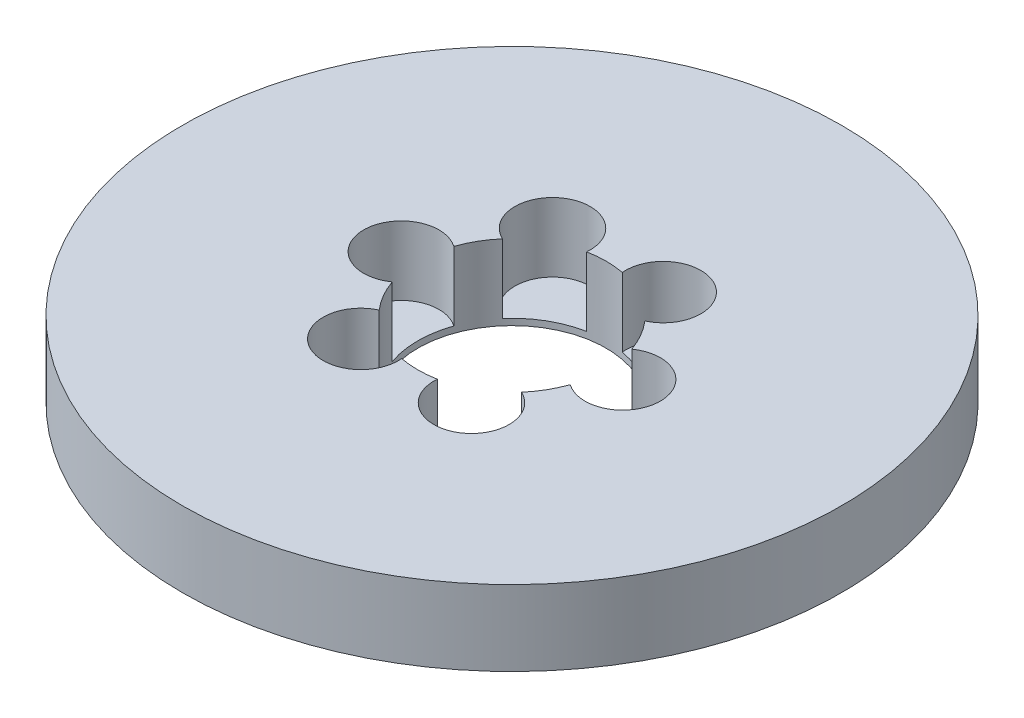
ISO-10303-21;
HEADER;
FILE_DESCRIPTION(('STEP AP214'),'2;1');
FILE_NAME('part.step','',(''),(''),'','','');
FILE_SCHEMA(('AUTOMOTIVE_DESIGN { 1 0 10303 214 1 1 1 1 }'));
ENDSEC;
DATA;
#1=APPLICATION_CONTEXT('core data for automotive mechanical design processes');
#2=APPLICATION_PROTOCOL_DEFINITION('international standard','automotive_design',2000,#1);
#3=PRODUCT_CONTEXT('',#1,'mechanical');
#4=PRODUCT('Part','Part','',(#3));
#5=PRODUCT_RELATED_PRODUCT_CATEGORY('part','',(#4));
#6=PRODUCT_DEFINITION_FORMATION('','',#4);
#7=PRODUCT_DEFINITION_CONTEXT('part definition',#1,'design');
#8=PRODUCT_DEFINITION('design','',#6,#7);
#9=PRODUCT_DEFINITION_SHAPE('','',#8);
#10=(LENGTH_UNIT() NAMED_UNIT(*) SI_UNIT(.MILLI.,.METRE.));
#11=(NAMED_UNIT(*) PLANE_ANGLE_UNIT() SI_UNIT($,.RADIAN.));
#12=(NAMED_UNIT(*) SI_UNIT($,.STERADIAN.) SOLID_ANGLE_UNIT());
#13=UNCERTAINTY_MEASURE_WITH_UNIT(LENGTH_MEASURE(1.E-05),#10,'distance_accuracy_value','');
#14=(GEOMETRIC_REPRESENTATION_CONTEXT(3) GLOBAL_UNCERTAINTY_ASSIGNED_CONTEXT((#13)) GLOBAL_UNIT_ASSIGNED_CONTEXT((#10,
#11,#12)) REPRESENTATION_CONTEXT('',''));
#15=CARTESIAN_POINT('',(0.,0.,0.));
#16=DIRECTION('',(0.,0.,1.));
#17=DIRECTION('',(1.,0.,0.));
#18=AXIS2_PLACEMENT_3D('',#15,#16,#17);
#19=CARTESIAN_POINT('',(0.,20.,0.));
#20=DIRECTION('',(0.,-1.,0.));
#21=DIRECTION('',(0.,0.,-1.));
#22=AXIS2_PLACEMENT_3D('',#19,#20,#21);
#23=CYLINDRICAL_SURFACE('',#22,87.5);
#24=CARTESIAN_POINT('',(0.,20.,0.));
#25=DIRECTION('',(0.,1.,0.));
#26=DIRECTION('',(0.,0.,1.));
#27=AXIS2_PLACEMENT_3D('',#24,#25,#26);
#28=CIRCLE('',#27,87.5);
#29=CARTESIAN_POINT('',(0.,20.,87.5));
#30=VERTEX_POINT('',#29);
#31=EDGE_CURVE('E171',#30,#30,#28,.T.);
#32=ORIENTED_EDGE('',*,*,#31,.F.);
#33=EDGE_LOOP('',(#32));
#34=FACE_BOUND('',#33,.T.);
#35=CARTESIAN_POINT('',(0.,0.,0.));
#36=DIRECTION('',(0.,1.,0.));
#37=DIRECTION('',(0.,0.,1.));
#38=AXIS2_PLACEMENT_3D('',#35,#36,#37);
#39=CIRCLE('',#38,87.5);
#40=CARTESIAN_POINT('',(0.,0.,87.5));
#41=VERTEX_POINT('',#40);
#42=EDGE_CURVE('E157',#41,#41,#39,.T.);
#43=ORIENTED_EDGE('',*,*,#42,.T.);
#44=EDGE_LOOP('',(#43));
#45=FACE_BOUND('',#44,.T.);
#46=ADVANCED_FACE('F39',(#34,#45),#23,.T.);
#47=CARTESIAN_POINT('',(0.,20.,0.));
#48=DIRECTION('',(0.,1.,0.));
#49=DIRECTION('',(0.,0.,1.));
#50=AXIS2_PLACEMENT_3D('',#47,#48,#49);
#51=PLANE('',#50);
#52=CARTESIAN_POINT('',(-14.6925083448356,20.,-25.4481709438842));
#53=DIRECTION('',(0.,1.,0.));
#54=DIRECTION('',(-0.866025403784433,0.,0.50000000000001));
#55=AXIS2_PLACEMENT_3D('',#52,#53,#54);
#56=CIRCLE('',#55,10.);
#57=CARTESIAN_POINT('',(-4.73311850292256,20.,-24.547863231599));
#58=VERTEX_POINT('',#57);
#59=CARTESIAN_POINT('',(-18.8925139157298,20.,-16.3729324784522));
#60=VERTEX_POINT('',#59);
#61=EDGE_CURVE('E214',#58,#60,#56,.T.);
#62=ORIENTED_EDGE('',*,*,#61,.F.);
#63=CARTESIAN_POINT('',(0.,20.,0.));
#64=DIRECTION('',(0.,1.,0.));
#65=DIRECTION('',(0.,0.,1.));
#66=AXIS2_PLACEMENT_3D('',#63,#64,#65);
#67=CIRCLE('',#66,25.);
#68=CARTESIAN_POINT('',(4.73311850292204,20.,-24.5478632315991));
#69=VERTEX_POINT('',#68);
#70=EDGE_CURVE('E272',#69,#58,#67,.T.);
#71=ORIENTED_EDGE('',*,*,#70,.F.);
#72=CARTESIAN_POINT('',(14.692508344835,20.,-25.4481709438845));
#73=DIRECTION('',(0.,1.,0.));
#74=DIRECTION('',(-0.866025403784443,0.,-0.499999999999992));
#75=AXIS2_PLACEMENT_3D('',#72,#73,#74);
#76=CIRCLE('',#75,10.);
#77=CARTESIAN_POINT('',(18.8925139157295,20.,-16.3729324784526));
#78=VERTEX_POINT('',#77);
#79=EDGE_CURVE('E285',#78,#69,#76,.T.);
#80=ORIENTED_EDGE('',*,*,#79,.F.);
#81=CARTESIAN_POINT('',(23.6256324186519,20.,-8.17493075314669));
#82=VERTEX_POINT('',#81);
#83=EDGE_CURVE('E165',#82,#78,#67,.T.);
#84=ORIENTED_EDGE('',*,*,#83,.F.);
#85=CARTESIAN_POINT('',(29.3850166896705,20.,0.));
#86=DIRECTION('',(0.,1.,0.));
#87=DIRECTION('',(0.,0.,-1.));
#88=AXIS2_PLACEMENT_3D('',#85,#86,#87);
#89=CIRCLE('',#88,10.);
#90=CARTESIAN_POINT('',(23.6256324186519,20.,8.17493075314669));
#91=VERTEX_POINT('',#90);
#92=EDGE_CURVE('E281',#91,#82,#89,.T.);
#93=ORIENTED_EDGE('',*,*,#92,.F.);
#94=CARTESIAN_POINT('',(18.8925139157297,20.,16.3729324784523));
#95=VERTEX_POINT('',#94);
#96=EDGE_CURVE('E160',#95,#91,#67,.T.);
#97=ORIENTED_EDGE('',*,*,#96,.F.);
#98=CARTESIAN_POINT('',(14.6925083448354,20.,25.4481709438843));
#99=DIRECTION('',(0.,1.,0.));
#100=DIRECTION('',(0.866025403784436,0.,-0.500000000000004));
#101=AXIS2_PLACEMENT_3D('',#98,#99,#100);
#102=CIRCLE('',#101,10.);
#103=CARTESIAN_POINT('',(4.73311850292239,20.,24.5478632315991));
#104=VERTEX_POINT('',#103);
#105=EDGE_CURVE('E154',#104,#95,#102,.T.);
#106=ORIENTED_EDGE('',*,*,#105,.F.);
#107=CARTESIAN_POINT('',(-4.73311850292221,20.,24.5478632315991));
#108=VERTEX_POINT('',#107);
#109=EDGE_CURVE('E150',#108,#104,#67,.T.);
#110=ORIENTED_EDGE('',*,*,#109,.F.);
#111=CARTESIAN_POINT('',(-14.6925083448352,20.,25.4481709438844));
#112=DIRECTION('',(0.,1.,0.));
#113=DIRECTION('',(0.86602540378444,0.,0.499999999999998));
#114=AXIS2_PLACEMENT_3D('',#111,#112,#113);
#115=CIRCLE('',#114,10.);
#116=CARTESIAN_POINT('',(-18.8925139157296,20.,16.3729324784525));
#117=VERTEX_POINT('',#116);
#118=EDGE_CURVE('E127',#117,#108,#115,.T.);
#119=ORIENTED_EDGE('',*,*,#118,.F.);
#120=CARTESIAN_POINT('',(-23.6256324186519,20.,8.17493075314669));
#121=VERTEX_POINT('',#120);
#122=EDGE_CURVE('E156',#121,#117,#67,.T.);
#123=ORIENTED_EDGE('',*,*,#122,.F.);
#124=CARTESIAN_POINT('',(-29.3850166896705,20.,0.));
#125=DIRECTION('',(0.,1.,0.));
#126=DIRECTION('',(0.,0.,1.));
#127=AXIS2_PLACEMENT_3D('',#124,#125,#126);
#128=CIRCLE('',#127,10.);
#129=CARTESIAN_POINT('',(-23.6256324186519,20.,-8.17493075314669));
#130=VERTEX_POINT('',#129);
#131=EDGE_CURVE('E164',#130,#121,#128,.T.);
#132=ORIENTED_EDGE('',*,*,#131,.F.);
#133=EDGE_CURVE('E159',#60,#130,#67,.T.);
#134=ORIENTED_EDGE('',*,*,#133,.F.);
#135=EDGE_LOOP('',(#62,#71,#80,#84,#93,#97,#106,#110,#119,#123,#132,#134));
#136=FACE_BOUND('',#135,.T.);
#137=ORIENTED_EDGE('',*,*,#31,.T.);
#138=EDGE_LOOP('',(#137));
#139=FACE_BOUND('',#138,.T.);
#140=ADVANCED_FACE('F155',(#136,#139),#51,.T.);
#141=CARTESIAN_POINT('',(0.,0.,0.));
#142=DIRECTION('',(0.,1.,0.));
#143=DIRECTION('',(0.,0.,1.));
#144=AXIS2_PLACEMENT_3D('',#141,#142,#143);
#145=PLANE('',#144);
#146=CARTESIAN_POINT('',(0.,0.,0.));
#147=DIRECTION('',(0.,1.,0.));
#148=DIRECTION('',(0.,0.,1.));
#149=AXIS2_PLACEMENT_3D('',#146,#147,#148);
#150=CIRCLE('',#149,25.);
#151=CARTESIAN_POINT('',(0.,0.,25.));
#152=VERTEX_POINT('',#151);
#153=EDGE_CURVE('E170',#152,#152,#150,.T.);
#154=ORIENTED_EDGE('',*,*,#153,.T.);
#155=EDGE_LOOP('',(#154));
#156=FACE_BOUND('',#155,.T.);
#157=ORIENTED_EDGE('',*,*,#42,.F.);
#158=EDGE_LOOP('',(#157));
#159=FACE_BOUND('',#158,.T.);
#160=ADVANCED_FACE('F232',(#156,#159),#145,.F.);
#161=CARTESIAN_POINT('',(0.,20.,0.));
#162=DIRECTION('',(0.,-1.,0.));
#163=DIRECTION('',(0.,0.,-1.));
#164=AXIS2_PLACEMENT_3D('',#161,#162,#163);
#165=CYLINDRICAL_SURFACE('',#164,25.);
#166=DIRECTION('',(0.,1.,0.));
#167=VECTOR('',#166,1.);
#168=CARTESIAN_POINT('',(-4.73311850292256,10.8508104567928,-24.547863231599));
#169=LINE('',#168,#167);
#170=CARTESIAN_POINT('',(-4.73311850292256,1.70162091358557,-24.547863231599));
#171=VERTEX_POINT('',#170);
#172=EDGE_CURVE('E11',#171,#58,#169,.T.);
#173=ORIENTED_EDGE('',*,*,#172,.F.);
#174=CARTESIAN_POINT('',(0.,1.70162091358557,0.));
#175=DIRECTION('',(0.,1.,0.));
#176=DIRECTION('',(0.,0.,1.));
#177=AXIS2_PLACEMENT_3D('',#174,#175,#176);
#178=CIRCLE('',#177,25.);
#179=CARTESIAN_POINT('',(-18.8925139157298,1.70162091358557,-16.3729324784522));
#180=VERTEX_POINT('',#179);
#181=EDGE_CURVE('E209',#171,#180,#178,.T.);
#182=ORIENTED_EDGE('',*,*,#181,.T.);
#183=DIRECTION('',(0.,1.,0.));
#184=VECTOR('',#183,1.);
#185=CARTESIAN_POINT('',(-18.8925139157298,10.8508104567928,-16.3729324784522));
#186=LINE('',#185,#184);
#187=EDGE_CURVE('E46',#60,#180,#186,.F.);
#188=ORIENTED_EDGE('',*,*,#187,.F.);
#189=ORIENTED_EDGE('',*,*,#133,.T.);
#190=DIRECTION('',(0.,1.,0.));
#191=VECTOR('',#190,1.);
#192=CARTESIAN_POINT('',(-23.6256324186519,10.8508104567928,-8.1749307531467));
#193=LINE('',#192,#191);
#194=CARTESIAN_POINT('',(-23.6256324186519,1.70162091358557,-8.17493075314669));
#195=VERTEX_POINT('',#194);
#196=EDGE_CURVE('E185',#195,#130,#193,.T.);
#197=ORIENTED_EDGE('',*,*,#196,.F.);
#198=CARTESIAN_POINT('',(0.,1.70162091358557,0.));
#199=DIRECTION('',(0.,1.,0.));
#200=DIRECTION('',(0.,0.,1.));
#201=AXIS2_PLACEMENT_3D('',#198,#199,#200);
#202=CIRCLE('',#201,25.);
#203=CARTESIAN_POINT('',(-23.6256324186519,1.70162091358557,8.17493075314669));
#204=VERTEX_POINT('',#203);
#205=EDGE_CURVE('E173',#195,#204,#202,.T.);
#206=ORIENTED_EDGE('',*,*,#205,.T.);
#207=DIRECTION('',(0.,1.,0.));
#208=VECTOR('',#207,1.);
#209=CARTESIAN_POINT('',(-23.6256324186519,10.8508104567928,8.1749307531467));
#210=LINE('',#209,#208);
#211=EDGE_CURVE('E178',#121,#204,#210,.F.);
#212=ORIENTED_EDGE('',*,*,#211,.F.);
#213=ORIENTED_EDGE('',*,*,#122,.T.);
#214=DIRECTION('',(0.,1.,0.));
#215=VECTOR('',#214,1.);
#216=CARTESIAN_POINT('',(-18.8925139157296,10.8508104567928,16.3729324784525));
#217=LINE('',#216,#215);
#218=CARTESIAN_POINT('',(-18.8925139157296,1.70162091358557,16.3729324784525));
#219=VERTEX_POINT('',#218);
#220=EDGE_CURVE('E132',#219,#117,#217,.T.);
#221=ORIENTED_EDGE('',*,*,#220,.F.);
#222=CARTESIAN_POINT('',(0.,1.70162091358557,0.));
#223=DIRECTION('',(0.,1.,0.));
#224=DIRECTION('',(0.,0.,1.));
#225=AXIS2_PLACEMENT_3D('',#222,#223,#224);
#226=CIRCLE('',#225,25.);
#227=CARTESIAN_POINT('',(-4.73311850292221,1.70162091358557,24.5478632315991));
#228=VERTEX_POINT('',#227);
#229=EDGE_CURVE('E146',#219,#228,#226,.T.);
#230=ORIENTED_EDGE('',*,*,#229,.T.);
#231=DIRECTION('',(0.,1.,0.));
#232=VECTOR('',#231,1.);
#233=CARTESIAN_POINT('',(-4.73311850292221,10.8508104567928,24.5478632315991));
#234=LINE('',#233,#232);
#235=EDGE_CURVE('E128',#108,#228,#234,.F.);
#236=ORIENTED_EDGE('',*,*,#235,.F.);
#237=ORIENTED_EDGE('',*,*,#109,.T.);
#238=DIRECTION('',(0.,1.,0.));
#239=VECTOR('',#238,1.);
#240=CARTESIAN_POINT('',(4.73311850292239,10.8508104567928,24.5478632315991));
#241=LINE('',#240,#239);
#242=CARTESIAN_POINT('',(4.73311850292239,1.70162091358557,24.5478632315991));
#243=VERTEX_POINT('',#242);
#244=EDGE_CURVE('E192',#243,#104,#241,.T.);
#245=ORIENTED_EDGE('',*,*,#244,.F.);
#246=CARTESIAN_POINT('',(0.,1.70162091358557,0.));
#247=DIRECTION('',(0.,1.,0.));
#248=DIRECTION('',(0.,0.,1.));
#249=AXIS2_PLACEMENT_3D('',#246,#247,#248);
#250=CIRCLE('',#249,25.);
#251=CARTESIAN_POINT('',(18.8925139157297,1.70162091358557,16.3729324784523));
#252=VERTEX_POINT('',#251);
#253=EDGE_CURVE('E190',#243,#252,#250,.T.);
#254=ORIENTED_EDGE('',*,*,#253,.T.);
#255=DIRECTION('',(0.,1.,0.));
#256=VECTOR('',#255,1.);
#257=CARTESIAN_POINT('',(18.8925139157297,10.8508104567928,16.3729324784523));
#258=LINE('',#257,#256);
#259=EDGE_CURVE('E189',#95,#252,#258,.F.);
#260=ORIENTED_EDGE('',*,*,#259,.F.);
#261=ORIENTED_EDGE('',*,*,#96,.T.);
#262=DIRECTION('',(0.,1.,0.));
#263=VECTOR('',#262,1.);
#264=CARTESIAN_POINT('',(23.6256324186519,10.8508104567928,8.1749307531467));
#265=LINE('',#264,#263);
#266=CARTESIAN_POINT('',(23.6256324186519,1.70162091358557,8.17493075314669));
#267=VERTEX_POINT('',#266);
#268=EDGE_CURVE('E203',#267,#91,#265,.T.);
#269=ORIENTED_EDGE('',*,*,#268,.F.);
#270=CARTESIAN_POINT('',(0.,1.70162091358557,0.));
#271=DIRECTION('',(0.,1.,0.));
#272=DIRECTION('',(0.,0.,1.));
#273=AXIS2_PLACEMENT_3D('',#270,#271,#272);
#274=CIRCLE('',#273,25.);
#275=CARTESIAN_POINT('',(23.6256324186519,1.70162091358557,-8.17493075314669));
#276=VERTEX_POINT('',#275);
#277=EDGE_CURVE('E194',#267,#276,#274,.T.);
#278=ORIENTED_EDGE('',*,*,#277,.T.);
#279=DIRECTION('',(0.,1.,0.));
#280=VECTOR('',#279,1.);
#281=CARTESIAN_POINT('',(23.6256324186519,10.8508104567928,-8.1749307531467));
#282=LINE('',#281,#280);
#283=EDGE_CURVE('E196',#82,#276,#282,.F.);
#284=ORIENTED_EDGE('',*,*,#283,.F.);
#285=ORIENTED_EDGE('',*,*,#83,.T.);
#286=DIRECTION('',(0.,1.,0.));
#287=VECTOR('',#286,1.);
#288=CARTESIAN_POINT('',(18.8925139157295,10.8508104567928,-16.3729324784526));
#289=LINE('',#288,#287);
#290=CARTESIAN_POINT('',(18.8925139157295,1.70162091358557,-16.3729324784526));
#291=VERTEX_POINT('',#290);
#292=EDGE_CURVE('E208',#291,#78,#289,.T.);
#293=ORIENTED_EDGE('',*,*,#292,.F.);
#294=CARTESIAN_POINT('',(0.,1.70162091358557,0.));
#295=DIRECTION('',(0.,1.,0.));
#296=DIRECTION('',(0.,0.,1.));
#297=AXIS2_PLACEMENT_3D('',#294,#295,#296);
#298=CIRCLE('',#297,25.);
#299=CARTESIAN_POINT('',(4.73311850292204,1.70162091358557,-24.5478632315991));
#300=VERTEX_POINT('',#299);
#301=EDGE_CURVE('E201',#291,#300,#298,.T.);
#302=ORIENTED_EDGE('',*,*,#301,.T.);
#303=DIRECTION('',(0.,1.,0.));
#304=VECTOR('',#303,1.);
#305=CARTESIAN_POINT('',(4.73311850292204,10.8508104567928,-24.5478632315991));
#306=LINE('',#305,#304);
#307=EDGE_CURVE('E206',#69,#300,#306,.F.);
#308=ORIENTED_EDGE('',*,*,#307,.F.);
#309=ORIENTED_EDGE('',*,*,#70,.T.);
#310=EDGE_LOOP('',(#173,#182,#188,#189,#197,#206,#212,#213,#221,#230,#236,#237,#245,#254,#260,
#261,#269,#278,#284,#285,#293,#302,#308,#309));
#311=FACE_BOUND('',#310,.T.);
#312=ORIENTED_EDGE('',*,*,#153,.F.);
#313=EDGE_LOOP('',(#312));
#314=FACE_BOUND('',#313,.T.);
#315=ADVANCED_FACE('F145',(#311,#314),#165,.F.);
#316=CARTESIAN_POINT('',(-29.3850166896705,1.70162091358557,0.));
#317=DIRECTION('',(0.,1.,0.));
#318=DIRECTION('',(0.,0.,1.));
#319=AXIS2_PLACEMENT_3D('',#316,#317,#318);
#320=CYLINDRICAL_SURFACE('',#319,10.);
#321=ORIENTED_EDGE('',*,*,#196,.T.);
#322=ORIENTED_EDGE('',*,*,#131,.T.);
#323=ORIENTED_EDGE('',*,*,#211,.T.);
#324=CARTESIAN_POINT('',(-29.3850166896705,1.70162091358557,0.));
#325=DIRECTION('',(0.,1.,0.));
#326=DIRECTION('',(0.,0.,1.));
#327=AXIS2_PLACEMENT_3D('',#324,#325,#326);
#328=CIRCLE('',#327,10.);
#329=EDGE_CURVE('E168',#195,#204,#328,.T.);
#330=ORIENTED_EDGE('',*,*,#329,.F.);
#331=EDGE_LOOP('',(#321,#322,#323,#330));
#332=FACE_BOUND('',#331,.T.);
#333=ADVANCED_FACE('F243',(#332),#320,.F.);
#334=CARTESIAN_POINT('',(-29.3850166896705,1.70162091358557,0.));
#335=DIRECTION('',(0.,1.,0.));
#336=DIRECTION('',(0.,0.,1.));
#337=AXIS2_PLACEMENT_3D('',#334,#335,#336);
#338=PLANE('',#337);
#339=ORIENTED_EDGE('',*,*,#329,.T.);
#340=ORIENTED_EDGE('',*,*,#205,.F.);
#341=EDGE_LOOP('',(#339,#340));
#342=FACE_BOUND('',#341,.T.);
#343=ADVANCED_FACE('F247',(#342),#338,.T.);
#344=CARTESIAN_POINT('',(-14.6925083448352,1.70162091358557,25.4481709438844));
#345=DIRECTION('',(0.,1.,0.));
#346=DIRECTION('',(0.,0.,1.));
#347=AXIS2_PLACEMENT_3D('',#344,#345,#346);
#348=CYLINDRICAL_SURFACE('',#347,10.);
#349=ORIENTED_EDGE('',*,*,#220,.T.);
#350=ORIENTED_EDGE('',*,*,#118,.T.);
#351=ORIENTED_EDGE('',*,*,#235,.T.);
#352=CARTESIAN_POINT('',(-14.6925083448352,1.70162091358557,25.4481709438844));
#353=DIRECTION('',(0.,1.,0.));
#354=DIRECTION('',(0.86602540378444,0.,0.499999999999998));
#355=AXIS2_PLACEMENT_3D('',#352,#353,#354);
#356=CIRCLE('',#355,10.);
#357=EDGE_CURVE('E137',#219,#228,#356,.T.);
#358=ORIENTED_EDGE('',*,*,#357,.F.);
#359=EDGE_LOOP('',(#349,#350,#351,#358));
#360=FACE_BOUND('',#359,.T.);
#361=ADVANCED_FACE('F126',(#360),#348,.F.);
#362=CARTESIAN_POINT('',(-14.6925083448352,1.70162091358557,25.4481709438844));
#363=DIRECTION('',(0.,1.,0.));
#364=DIRECTION('',(0.86602540378444,0.,0.499999999999998));
#365=AXIS2_PLACEMENT_3D('',#362,#363,#364);
#366=PLANE('',#365);
#367=ORIENTED_EDGE('',*,*,#357,.T.);
#368=ORIENTED_EDGE('',*,*,#229,.F.);
#369=EDGE_LOOP('',(#367,#368));
#370=FACE_BOUND('',#369,.T.);
#371=ADVANCED_FACE('F254',(#370),#366,.T.);
#372=CARTESIAN_POINT('',(14.6925083448354,1.70162091358557,25.4481709438843));
#373=DIRECTION('',(0.,1.,0.));
#374=DIRECTION('',(0.,0.,1.));
#375=AXIS2_PLACEMENT_3D('',#372,#373,#374);
#376=CYLINDRICAL_SURFACE('',#375,10.);
#377=ORIENTED_EDGE('',*,*,#244,.T.);
#378=ORIENTED_EDGE('',*,*,#105,.T.);
#379=ORIENTED_EDGE('',*,*,#259,.T.);
#380=CARTESIAN_POINT('',(14.6925083448354,1.70162091358557,25.4481709438843));
#381=DIRECTION('',(0.,1.,0.));
#382=DIRECTION('',(0.866025403784436,0.,-0.500000000000004));
#383=AXIS2_PLACEMENT_3D('',#380,#381,#382);
#384=CIRCLE('',#383,10.);
#385=EDGE_CURVE('E138',#243,#252,#384,.T.);
#386=ORIENTED_EDGE('',*,*,#385,.F.);
#387=EDGE_LOOP('',(#377,#378,#379,#386));
#388=FACE_BOUND('',#387,.T.);
#389=ADVANCED_FACE('F260',(#388),#376,.F.);
#390=CARTESIAN_POINT('',(14.6925083448354,1.70162091358557,25.4481709438843));
#391=DIRECTION('',(0.,1.,0.));
#392=DIRECTION('',(0.866025403784436,0.,-0.500000000000004));
#393=AXIS2_PLACEMENT_3D('',#390,#391,#392);
#394=PLANE('',#393);
#395=ORIENTED_EDGE('',*,*,#385,.T.);
#396=ORIENTED_EDGE('',*,*,#253,.F.);
#397=EDGE_LOOP('',(#395,#396));
#398=FACE_BOUND('',#397,.T.);
#399=ADVANCED_FACE('F265',(#398),#394,.T.);
#400=CARTESIAN_POINT('',(29.3850166896705,1.70162091358557,0.));
#401=DIRECTION('',(0.,1.,0.));
#402=DIRECTION('',(0.,0.,1.));
#403=AXIS2_PLACEMENT_3D('',#400,#401,#402);
#404=CYLINDRICAL_SURFACE('',#403,10.);
#405=ORIENTED_EDGE('',*,*,#268,.T.);
#406=ORIENTED_EDGE('',*,*,#92,.T.);
#407=ORIENTED_EDGE('',*,*,#283,.T.);
#408=CARTESIAN_POINT('',(29.3850166896705,1.70162091358557,0.));
#409=DIRECTION('',(0.,1.,0.));
#410=DIRECTION('',(0.,0.,-1.));
#411=AXIS2_PLACEMENT_3D('',#408,#409,#410);
#412=CIRCLE('',#411,10.);
#413=EDGE_CURVE('E287',#267,#276,#412,.T.);
#414=ORIENTED_EDGE('',*,*,#413,.F.);
#415=EDGE_LOOP('',(#405,#406,#407,#414));
#416=FACE_BOUND('',#415,.T.);
#417=ADVANCED_FACE('F300',(#416),#404,.F.);
#418=CARTESIAN_POINT('',(29.3850166896705,1.70162091358557,0.));
#419=DIRECTION('',(0.,1.,0.));
#420=DIRECTION('',(0.,0.,-1.));
#421=AXIS2_PLACEMENT_3D('',#418,#419,#420);
#422=PLANE('',#421);
#423=ORIENTED_EDGE('',*,*,#413,.T.);
#424=ORIENTED_EDGE('',*,*,#277,.F.);
#425=EDGE_LOOP('',(#423,#424));
#426=FACE_BOUND('',#425,.T.);
#427=ADVANCED_FACE('F298',(#426),#422,.T.);
#428=CARTESIAN_POINT('',(14.692508344835,1.70162091358557,-25.4481709438845));
#429=DIRECTION('',(0.,1.,0.));
#430=DIRECTION('',(0.,0.,1.));
#431=AXIS2_PLACEMENT_3D('',#428,#429,#430);
#432=CYLINDRICAL_SURFACE('',#431,10.);
#433=ORIENTED_EDGE('',*,*,#292,.T.);
#434=ORIENTED_EDGE('',*,*,#79,.T.);
#435=ORIENTED_EDGE('',*,*,#307,.T.);
#436=CARTESIAN_POINT('',(14.692508344835,1.70162091358557,-25.4481709438845));
#437=DIRECTION('',(0.,1.,0.));
#438=DIRECTION('',(-0.866025403784443,0.,-0.499999999999992));
#439=AXIS2_PLACEMENT_3D('',#436,#437,#438);
#440=CIRCLE('',#439,10.);
#441=EDGE_CURVE('E56',#291,#300,#440,.T.);
#442=ORIENTED_EDGE('',*,*,#441,.F.);
#443=EDGE_LOOP('',(#433,#434,#435,#442));
#444=FACE_BOUND('',#443,.T.);
#445=ADVANCED_FACE('F301',(#444),#432,.F.);
#446=CARTESIAN_POINT('',(14.692508344835,1.70162091358557,-25.4481709438845));
#447=DIRECTION('',(0.,1.,0.));
#448=DIRECTION('',(-0.866025403784443,0.,-0.499999999999992));
#449=AXIS2_PLACEMENT_3D('',#446,#447,#448);
#450=PLANE('',#449);
#451=ORIENTED_EDGE('',*,*,#441,.T.);
#452=ORIENTED_EDGE('',*,*,#301,.F.);
#453=EDGE_LOOP('',(#451,#452));
#454=FACE_BOUND('',#453,.T.);
#455=ADVANCED_FACE('F221',(#454),#450,.T.);
#456=CARTESIAN_POINT('',(-14.6925083448356,1.70162091358557,-25.4481709438842));
#457=DIRECTION('',(0.,1.,0.));
#458=DIRECTION('',(0.,0.,1.));
#459=AXIS2_PLACEMENT_3D('',#456,#457,#458);
#460=CYLINDRICAL_SURFACE('',#459,10.);
#461=ORIENTED_EDGE('',*,*,#172,.T.);
#462=ORIENTED_EDGE('',*,*,#61,.T.);
#463=ORIENTED_EDGE('',*,*,#187,.T.);
#464=CARTESIAN_POINT('',(-14.6925083448356,1.70162091358557,-25.4481709438842));
#465=DIRECTION('',(0.,1.,0.));
#466=DIRECTION('',(-0.866025403784433,0.,0.50000000000001));
#467=AXIS2_PLACEMENT_3D('',#464,#465,#466);
#468=CIRCLE('',#467,10.);
#469=EDGE_CURVE('E55',#171,#180,#468,.T.);
#470=ORIENTED_EDGE('',*,*,#469,.F.);
#471=EDGE_LOOP('',(#461,#462,#463,#470));
#472=FACE_BOUND('',#471,.T.);
#473=ADVANCED_FACE('F212',(#472),#460,.F.);
#474=CARTESIAN_POINT('',(-14.6925083448356,1.70162091358557,-25.4481709438842));
#475=DIRECTION('',(0.,1.,0.));
#476=DIRECTION('',(-0.866025403784433,0.,0.50000000000001));
#477=AXIS2_PLACEMENT_3D('',#474,#475,#476);
#478=PLANE('',#477);
#479=ORIENTED_EDGE('',*,*,#469,.T.);
#480=ORIENTED_EDGE('',*,*,#181,.F.);
#481=EDGE_LOOP('',(#479,#480));
#482=FACE_BOUND('',#481,.T.);
#483=ADVANCED_FACE('F217',(#482),#478,.T.);
#484=CLOSED_SHELL('',(#46,#140,#160,#315,#333,#343,#361,#371,#389,#399,#417,#427,#445,#455,#473,#483));
#485=MANIFOLD_SOLID_BREP('B2',#484);
#486=ADVANCED_BREP_SHAPE_REPRESENTATION('',(#18,#485),#14);
#487=SHAPE_DEFINITION_REPRESENTATION(#9,#486);
ENDSEC;
END-ISO-10303-21;
